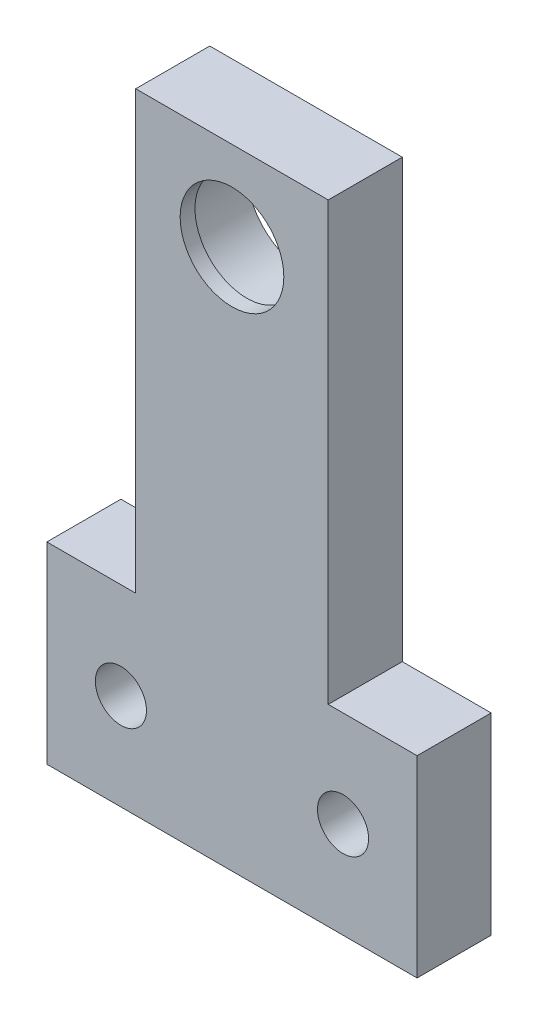
ISO-10303-21;
HEADER;
FILE_DESCRIPTION(('STEP AP214'),'2;1');
FILE_NAME('part.step','',(''),(''),'','','');
FILE_SCHEMA(('AUTOMOTIVE_DESIGN { 1 0 10303 214 1 1 1 1 }'));
ENDSEC;
DATA;
#1=APPLICATION_CONTEXT('core data for automotive mechanical design processes');
#2=APPLICATION_PROTOCOL_DEFINITION('international standard','automotive_design',2000,#1);
#3=PRODUCT_CONTEXT('',#1,'mechanical');
#4=PRODUCT('Part','Part','',(#3));
#5=PRODUCT_RELATED_PRODUCT_CATEGORY('part','',(#4));
#6=PRODUCT_DEFINITION_FORMATION('','',#4);
#7=PRODUCT_DEFINITION_CONTEXT('part definition',#1,'design');
#8=PRODUCT_DEFINITION('design','',#6,#7);
#9=PRODUCT_DEFINITION_SHAPE('','',#8);
#10=(LENGTH_UNIT() NAMED_UNIT(*) SI_UNIT(.MILLI.,.METRE.));
#11=(NAMED_UNIT(*) PLANE_ANGLE_UNIT() SI_UNIT($,.RADIAN.));
#12=(NAMED_UNIT(*) SI_UNIT($,.STERADIAN.) SOLID_ANGLE_UNIT());
#13=UNCERTAINTY_MEASURE_WITH_UNIT(LENGTH_MEASURE(1.E-05),#10,'distance_accuracy_value','');
#14=(GEOMETRIC_REPRESENTATION_CONTEXT(3) GLOBAL_UNCERTAINTY_ASSIGNED_CONTEXT((#13)) GLOBAL_UNIT_ASSIGNED_CONTEXT((#10,
#11,#12)) REPRESENTATION_CONTEXT('',''));
#15=CARTESIAN_POINT('',(0.,0.,0.));
#16=DIRECTION('',(0.,0.,1.));
#17=DIRECTION('',(1.,0.,0.));
#18=AXIS2_PLACEMENT_3D('',#15,#16,#17);
#19=CARTESIAN_POINT('',(0.,73.,10.));
#20=DIRECTION('',(0.,0.,-1.));
#21=DIRECTION('',(-1.,0.,0.));
#22=AXIS2_PLACEMENT_3D('',#19,#20,#21);
#23=CYLINDRICAL_SURFACE('',#22,7.);
#24=CARTESIAN_POINT('',(0.,73.,10.));
#25=DIRECTION('',(0.,0.,1.));
#26=DIRECTION('',(1.,0.,0.));
#27=AXIS2_PLACEMENT_3D('',#24,#25,#26);
#28=CIRCLE('',#27,7.);
#29=CARTESIAN_POINT('',(7.,73.,10.));
#30=VERTEX_POINT('',#29);
#31=EDGE_CURVE('E140',#30,#30,#28,.T.);
#32=ORIENTED_EDGE('',*,*,#31,.T.);
#33=EDGE_LOOP('',(#32));
#34=FACE_BOUND('',#33,.T.);
#35=CARTESIAN_POINT('',(0.,73.,8.));
#36=DIRECTION('',(0.,0.,-1.));
#37=DIRECTION('',(-1.,0.,0.));
#38=AXIS2_PLACEMENT_3D('',#35,#36,#37);
#39=CIRCLE('',#38,7.);
#40=CARTESIAN_POINT('',(-7.,73.,8.));
#41=VERTEX_POINT('',#40);
#42=EDGE_CURVE('E41',#41,#41,#39,.T.);
#43=ORIENTED_EDGE('',*,*,#42,.T.);
#44=EDGE_LOOP('',(#43));
#45=FACE_BOUND('',#44,.T.);
#46=ADVANCED_FACE('F37',(#34,#45),#23,.F.);
#47=CARTESIAN_POINT('',(0.,0.,10.));
#48=DIRECTION('',(0.,0.,1.));
#49=DIRECTION('',(1.,0.,0.));
#50=AXIS2_PLACEMENT_3D('',#47,#48,#49);
#51=PLANE('',#50);
#52=CARTESIAN_POINT('',(15.,13.,10.));
#53=DIRECTION('',(0.,0.,1.));
#54=DIRECTION('',(-1.,0.,0.));
#55=AXIS2_PLACEMENT_3D('',#52,#53,#54);
#56=CIRCLE('',#55,3.45000000000001);
#57=CARTESIAN_POINT('',(11.55,13.,10.));
#58=VERTEX_POINT('',#57);
#59=EDGE_CURVE('E188',#58,#58,#56,.T.);
#60=ORIENTED_EDGE('',*,*,#59,.F.);
#61=EDGE_LOOP('',(#60));
#62=FACE_BOUND('',#61,.T.);
#63=DIRECTION('',(0.,-1.,0.));
#64=VECTOR('',#63,1.);
#65=CARTESIAN_POINT('',(-25.,26.,10.));
#66=LINE('',#65,#64);
#67=CARTESIAN_POINT('',(-25.,26.,10.));
#68=VERTEX_POINT('',#67);
#69=CARTESIAN_POINT('',(-25.,0.,10.));
#70=VERTEX_POINT('',#69);
#71=EDGE_CURVE('E151',#68,#70,#66,.T.);
#72=ORIENTED_EDGE('',*,*,#71,.T.);
#73=DIRECTION('',(1.,0.,0.));
#74=VECTOR('',#73,1.);
#75=CARTESIAN_POINT('',(-25.,0.,10.));
#76=LINE('',#75,#74);
#77=CARTESIAN_POINT('',(25.,0.,10.));
#78=VERTEX_POINT('',#77);
#79=EDGE_CURVE('E98',#70,#78,#76,.T.);
#80=ORIENTED_EDGE('',*,*,#79,.T.);
#81=DIRECTION('',(0.,1.,0.));
#82=VECTOR('',#81,1.);
#83=CARTESIAN_POINT('',(25.,0.,10.));
#84=LINE('',#83,#82);
#85=CARTESIAN_POINT('',(25.,26.,10.));
#86=VERTEX_POINT('',#85);
#87=EDGE_CURVE('E167',#78,#86,#84,.T.);
#88=ORIENTED_EDGE('',*,*,#87,.T.);
#89=DIRECTION('',(-1.,0.,0.));
#90=VECTOR('',#89,1.);
#91=CARTESIAN_POINT('',(25.,26.,10.));
#92=LINE('',#91,#90);
#93=CARTESIAN_POINT('',(13.,26.,10.));
#94=VERTEX_POINT('',#93);
#95=EDGE_CURVE('E180',#86,#94,#92,.T.);
#96=ORIENTED_EDGE('',*,*,#95,.T.);
#97=DIRECTION('',(0.,1.,0.));
#98=VECTOR('',#97,1.);
#99=CARTESIAN_POINT('',(13.,26.,10.));
#100=LINE('',#99,#98);
#101=CARTESIAN_POINT('',(13.,85.,10.));
#102=VERTEX_POINT('',#101);
#103=EDGE_CURVE('E118',#94,#102,#100,.T.);
#104=ORIENTED_EDGE('',*,*,#103,.T.);
#105=DIRECTION('',(-1.,0.,0.));
#106=VECTOR('',#105,1.);
#107=CARTESIAN_POINT('',(13.,85.,10.));
#108=LINE('',#107,#106);
#109=CARTESIAN_POINT('',(-13.,85.,10.));
#110=VERTEX_POINT('',#109);
#111=EDGE_CURVE('E111',#102,#110,#108,.T.);
#112=ORIENTED_EDGE('',*,*,#111,.T.);
#113=DIRECTION('',(0.,-1.,0.));
#114=VECTOR('',#113,1.);
#115=CARTESIAN_POINT('',(-13.,85.,10.));
#116=LINE('',#115,#114);
#117=CARTESIAN_POINT('',(-13.,26.,10.));
#118=VERTEX_POINT('',#117);
#119=EDGE_CURVE('E116',#110,#118,#116,.T.);
#120=ORIENTED_EDGE('',*,*,#119,.T.);
#121=DIRECTION('',(-1.,0.,0.));
#122=VECTOR('',#121,1.);
#123=CARTESIAN_POINT('',(-13.,26.,10.));
#124=LINE('',#123,#122);
#125=EDGE_CURVE('E55',#118,#68,#124,.T.);
#126=ORIENTED_EDGE('',*,*,#125,.T.);
#127=EDGE_LOOP('',(#72,#80,#88,#96,#104,#112,#120,#126));
#128=FACE_BOUND('',#127,.T.);
#129=ORIENTED_EDGE('',*,*,#31,.F.);
#130=EDGE_LOOP('',(#129));
#131=FACE_BOUND('',#130,.T.);
#132=CARTESIAN_POINT('',(-15.,13.,10.));
#133=DIRECTION('',(0.,0.,1.));
#134=DIRECTION('',(1.,0.,0.));
#135=AXIS2_PLACEMENT_3D('',#132,#133,#134);
#136=CIRCLE('',#135,3.45);
#137=CARTESIAN_POINT('',(-11.55,13.,10.));
#138=VERTEX_POINT('',#137);
#139=EDGE_CURVE('E192',#138,#138,#136,.T.);
#140=ORIENTED_EDGE('',*,*,#139,.F.);
#141=EDGE_LOOP('',(#140));
#142=FACE_BOUND('',#141,.T.);
#143=ADVANCED_FACE('F113',(#62,#128,#131,#142),#51,.T.);
#144=CARTESIAN_POINT('',(0.,0.,0.));
#145=DIRECTION('',(0.,0.,1.));
#146=DIRECTION('',(1.,0.,0.));
#147=AXIS2_PLACEMENT_3D('',#144,#145,#146);
#148=PLANE('',#147);
#149=CARTESIAN_POINT('',(0.,73.,0.));
#150=DIRECTION('',(0.,0.,-1.));
#151=DIRECTION('',(-1.,0.,0.));
#152=AXIS2_PLACEMENT_3D('',#149,#150,#151);
#153=CIRCLE('',#152,8.05);
#154=CARTESIAN_POINT('',(-8.05,73.,0.));
#155=VERTEX_POINT('',#154);
#156=EDGE_CURVE('E200',#155,#155,#153,.T.);
#157=ORIENTED_EDGE('',*,*,#156,.F.);
#158=EDGE_LOOP('',(#157));
#159=FACE_BOUND('',#158,.T.);
#160=DIRECTION('',(0.,-1.,0.));
#161=VECTOR('',#160,1.);
#162=CARTESIAN_POINT('',(-25.,26.,0.));
#163=LINE('',#162,#161);
#164=CARTESIAN_POINT('',(-25.,26.,0.));
#165=VERTEX_POINT('',#164);
#166=CARTESIAN_POINT('',(-25.,0.,0.));
#167=VERTEX_POINT('',#166);
#168=EDGE_CURVE('E136',#165,#167,#163,.T.);
#169=ORIENTED_EDGE('',*,*,#168,.F.);
#170=DIRECTION('',(-1.,0.,0.));
#171=VECTOR('',#170,1.);
#172=CARTESIAN_POINT('',(-13.,26.,0.));
#173=LINE('',#172,#171);
#174=CARTESIAN_POINT('',(-13.,26.,0.));
#175=VERTEX_POINT('',#174);
#176=EDGE_CURVE('E90',#175,#165,#173,.T.);
#177=ORIENTED_EDGE('',*,*,#176,.F.);
#178=DIRECTION('',(0.,-1.,0.));
#179=VECTOR('',#178,1.);
#180=CARTESIAN_POINT('',(-13.,85.,0.));
#181=LINE('',#180,#179);
#182=CARTESIAN_POINT('',(-13.,85.,0.));
#183=VERTEX_POINT('',#182);
#184=EDGE_CURVE('E84',#183,#175,#181,.T.);
#185=ORIENTED_EDGE('',*,*,#184,.F.);
#186=DIRECTION('',(-1.,0.,0.));
#187=VECTOR('',#186,1.);
#188=CARTESIAN_POINT('',(13.,85.,0.));
#189=LINE('',#188,#187);
#190=CARTESIAN_POINT('',(13.,85.,0.));
#191=VERTEX_POINT('',#190);
#192=EDGE_CURVE('E126',#191,#183,#189,.T.);
#193=ORIENTED_EDGE('',*,*,#192,.F.);
#194=DIRECTION('',(0.,1.,0.));
#195=VECTOR('',#194,1.);
#196=CARTESIAN_POINT('',(13.,26.,0.));
#197=LINE('',#196,#195);
#198=CARTESIAN_POINT('',(13.,26.,0.));
#199=VERTEX_POINT('',#198);
#200=EDGE_CURVE('E146',#199,#191,#197,.T.);
#201=ORIENTED_EDGE('',*,*,#200,.F.);
#202=DIRECTION('',(-1.,0.,0.));
#203=VECTOR('',#202,1.);
#204=CARTESIAN_POINT('',(25.,26.,0.));
#205=LINE('',#204,#203);
#206=CARTESIAN_POINT('',(25.,26.,0.));
#207=VERTEX_POINT('',#206);
#208=EDGE_CURVE('E144',#207,#199,#205,.T.);
#209=ORIENTED_EDGE('',*,*,#208,.F.);
#210=DIRECTION('',(0.,1.,0.));
#211=VECTOR('',#210,1.);
#212=CARTESIAN_POINT('',(25.,0.,0.));
#213=LINE('',#212,#211);
#214=CARTESIAN_POINT('',(25.,0.,0.));
#215=VERTEX_POINT('',#214);
#216=EDGE_CURVE('E142',#215,#207,#213,.T.);
#217=ORIENTED_EDGE('',*,*,#216,.F.);
#218=DIRECTION('',(1.,0.,0.));
#219=VECTOR('',#218,1.);
#220=CARTESIAN_POINT('',(-25.,0.,0.));
#221=LINE('',#220,#219);
#222=EDGE_CURVE('E139',#167,#215,#221,.T.);
#223=ORIENTED_EDGE('',*,*,#222,.F.);
#224=EDGE_LOOP('',(#169,#177,#185,#193,#201,#209,#217,#223));
#225=FACE_BOUND('',#224,.T.);
#226=CARTESIAN_POINT('',(15.,13.,0.));
#227=DIRECTION('',(0.,0.,1.));
#228=DIRECTION('',(-1.,0.,0.));
#229=AXIS2_PLACEMENT_3D('',#226,#227,#228);
#230=CIRCLE('',#229,3.45000000000001);
#231=CARTESIAN_POINT('',(11.55,13.,0.));
#232=VERTEX_POINT('',#231);
#233=EDGE_CURVE('E189',#232,#232,#230,.T.);
#234=ORIENTED_EDGE('',*,*,#233,.T.);
#235=EDGE_LOOP('',(#234));
#236=FACE_BOUND('',#235,.T.);
#237=CARTESIAN_POINT('',(-15.,13.,0.));
#238=DIRECTION('',(0.,0.,1.));
#239=DIRECTION('',(1.,0.,0.));
#240=AXIS2_PLACEMENT_3D('',#237,#238,#239);
#241=CIRCLE('',#240,3.45);
#242=CARTESIAN_POINT('',(-11.55,13.,0.));
#243=VERTEX_POINT('',#242);
#244=EDGE_CURVE('E195',#243,#243,#241,.T.);
#245=ORIENTED_EDGE('',*,*,#244,.T.);
#246=EDGE_LOOP('',(#245));
#247=FACE_BOUND('',#246,.T.);
#248=ADVANCED_FACE('F171',(#159,#225,#236,#247),#148,.F.);
#249=CARTESIAN_POINT('',(-25.,26.,10.));
#250=DIRECTION('',(1.,0.,0.));
#251=DIRECTION('',(0.,1.,0.));
#252=AXIS2_PLACEMENT_3D('',#249,#250,#251);
#253=PLANE('',#252);
#254=ORIENTED_EDGE('',*,*,#168,.T.);
#255=DIRECTION('',(0.,0.,-1.));
#256=VECTOR('',#255,1.);
#257=CARTESIAN_POINT('',(-25.,0.,10.));
#258=LINE('',#257,#256);
#259=EDGE_CURVE('E11',#70,#167,#258,.T.);
#260=ORIENTED_EDGE('',*,*,#259,.F.);
#261=ORIENTED_EDGE('',*,*,#71,.F.);
#262=DIRECTION('',(0.,0.,-1.));
#263=VECTOR('',#262,1.);
#264=CARTESIAN_POINT('',(-25.,26.,10.));
#265=LINE('',#264,#263);
#266=EDGE_CURVE('E132',#68,#165,#265,.T.);
#267=ORIENTED_EDGE('',*,*,#266,.T.);
#268=EDGE_LOOP('',(#254,#260,#261,#267));
#269=FACE_BOUND('',#268,.T.);
#270=ADVANCED_FACE('F39',(#269),#253,.F.);
#271=CARTESIAN_POINT('',(-25.,0.,10.));
#272=DIRECTION('',(0.,1.,0.));
#273=DIRECTION('',(0.,0.,1.));
#274=AXIS2_PLACEMENT_3D('',#271,#272,#273);
#275=PLANE('',#274);
#276=ORIENTED_EDGE('',*,*,#222,.T.);
#277=DIRECTION('',(0.,0.,-1.));
#278=VECTOR('',#277,1.);
#279=CARTESIAN_POINT('',(25.,0.,10.));
#280=LINE('',#279,#278);
#281=EDGE_CURVE('E47',#78,#215,#280,.T.);
#282=ORIENTED_EDGE('',*,*,#281,.F.);
#283=ORIENTED_EDGE('',*,*,#79,.F.);
#284=ORIENTED_EDGE('',*,*,#259,.T.);
#285=EDGE_LOOP('',(#276,#282,#283,#284));
#286=FACE_BOUND('',#285,.T.);
#287=ADVANCED_FACE('F248',(#286),#275,.F.);
#288=CARTESIAN_POINT('',(25.,0.,10.));
#289=DIRECTION('',(-1.,0.,0.));
#290=DIRECTION('',(0.,-1.,0.));
#291=AXIS2_PLACEMENT_3D('',#288,#289,#290);
#292=PLANE('',#291);
#293=ORIENTED_EDGE('',*,*,#216,.T.);
#294=DIRECTION('',(0.,0.,-1.));
#295=VECTOR('',#294,1.);
#296=CARTESIAN_POINT('',(25.,26.,10.));
#297=LINE('',#296,#295);
#298=EDGE_CURVE('E158',#86,#207,#297,.T.);
#299=ORIENTED_EDGE('',*,*,#298,.F.);
#300=ORIENTED_EDGE('',*,*,#87,.F.);
#301=ORIENTED_EDGE('',*,*,#281,.T.);
#302=EDGE_LOOP('',(#293,#299,#300,#301));
#303=FACE_BOUND('',#302,.T.);
#304=ADVANCED_FACE('F165',(#303),#292,.F.);
#305=CARTESIAN_POINT('',(25.,26.,10.));
#306=DIRECTION('',(0.,-1.,0.));
#307=DIRECTION('',(1.,0.,0.));
#308=AXIS2_PLACEMENT_3D('',#305,#306,#307);
#309=PLANE('',#308);
#310=ORIENTED_EDGE('',*,*,#208,.T.);
#311=DIRECTION('',(0.,0.,-1.));
#312=VECTOR('',#311,1.);
#313=CARTESIAN_POINT('',(13.,26.,10.));
#314=LINE('',#313,#312);
#315=EDGE_CURVE('E155',#94,#199,#314,.T.);
#316=ORIENTED_EDGE('',*,*,#315,.F.);
#317=ORIENTED_EDGE('',*,*,#95,.F.);
#318=ORIENTED_EDGE('',*,*,#298,.T.);
#319=EDGE_LOOP('',(#310,#316,#317,#318));
#320=FACE_BOUND('',#319,.T.);
#321=ADVANCED_FACE('F176',(#320),#309,.F.);
#322=CARTESIAN_POINT('',(13.,26.,10.));
#323=DIRECTION('',(-1.,0.,0.));
#324=DIRECTION('',(0.,-1.,0.));
#325=AXIS2_PLACEMENT_3D('',#322,#323,#324);
#326=PLANE('',#325);
#327=ORIENTED_EDGE('',*,*,#200,.T.);
#328=DIRECTION('',(0.,0.,-1.));
#329=VECTOR('',#328,1.);
#330=CARTESIAN_POINT('',(13.,85.,10.));
#331=LINE('',#330,#329);
#332=EDGE_CURVE('E127',#102,#191,#331,.T.);
#333=ORIENTED_EDGE('',*,*,#332,.F.);
#334=ORIENTED_EDGE('',*,*,#103,.F.);
#335=ORIENTED_EDGE('',*,*,#315,.T.);
#336=EDGE_LOOP('',(#327,#333,#334,#335));
#337=FACE_BOUND('',#336,.T.);
#338=ADVANCED_FACE('F179',(#337),#326,.F.);
#339=CARTESIAN_POINT('',(13.,85.,10.));
#340=DIRECTION('',(0.,-1.,0.));
#341=DIRECTION('',(0.,0.,-1.));
#342=AXIS2_PLACEMENT_3D('',#339,#340,#341);
#343=PLANE('',#342);
#344=ORIENTED_EDGE('',*,*,#192,.T.);
#345=DIRECTION('',(0.,0.,-1.));
#346=VECTOR('',#345,1.);
#347=CARTESIAN_POINT('',(-13.,85.,10.));
#348=LINE('',#347,#346);
#349=EDGE_CURVE('E123',#110,#183,#348,.T.);
#350=ORIENTED_EDGE('',*,*,#349,.F.);
#351=ORIENTED_EDGE('',*,*,#111,.F.);
#352=ORIENTED_EDGE('',*,*,#332,.T.);
#353=EDGE_LOOP('',(#344,#350,#351,#352));
#354=FACE_BOUND('',#353,.T.);
#355=ADVANCED_FACE('F124',(#354),#343,.F.);
#356=CARTESIAN_POINT('',(-13.,85.,10.));
#357=DIRECTION('',(1.,0.,0.));
#358=DIRECTION('',(0.,1.,0.));
#359=AXIS2_PLACEMENT_3D('',#356,#357,#358);
#360=PLANE('',#359);
#361=ORIENTED_EDGE('',*,*,#184,.T.);
#362=DIRECTION('',(0.,0.,-1.));
#363=VECTOR('',#362,1.);
#364=CARTESIAN_POINT('',(-13.,26.,10.));
#365=LINE('',#364,#363);
#366=EDGE_CURVE('E128',#118,#175,#365,.T.);
#367=ORIENTED_EDGE('',*,*,#366,.F.);
#368=ORIENTED_EDGE('',*,*,#119,.F.);
#369=ORIENTED_EDGE('',*,*,#349,.T.);
#370=EDGE_LOOP('',(#361,#367,#368,#369));
#371=FACE_BOUND('',#370,.T.);
#372=ADVANCED_FACE('F130',(#371),#360,.F.);
#373=CARTESIAN_POINT('',(-13.,26.,10.));
#374=DIRECTION('',(0.,-1.,0.));
#375=DIRECTION('',(1.,0.,0.));
#376=AXIS2_PLACEMENT_3D('',#373,#374,#375);
#377=PLANE('',#376);
#378=ORIENTED_EDGE('',*,*,#176,.T.);
#379=ORIENTED_EDGE('',*,*,#266,.F.);
#380=ORIENTED_EDGE('',*,*,#125,.F.);
#381=ORIENTED_EDGE('',*,*,#366,.T.);
#382=EDGE_LOOP('',(#378,#379,#380,#381));
#383=FACE_BOUND('',#382,.T.);
#384=ADVANCED_FACE('F236',(#383),#377,.F.);
#385=CARTESIAN_POINT('',(15.,13.,10.));
#386=DIRECTION('',(0.,0.,-1.));
#387=DIRECTION('',(-1.,0.,0.));
#388=AXIS2_PLACEMENT_3D('',#385,#386,#387);
#389=CYLINDRICAL_SURFACE('',#388,3.45000000000001);
#390=ORIENTED_EDGE('',*,*,#59,.T.);
#391=EDGE_LOOP('',(#390));
#392=FACE_BOUND('',#391,.T.);
#393=ORIENTED_EDGE('',*,*,#233,.F.);
#394=EDGE_LOOP('',(#393));
#395=FACE_BOUND('',#394,.T.);
#396=ADVANCED_FACE('F230',(#392,#395),#389,.F.);
#397=CARTESIAN_POINT('',(-15.,13.,10.));
#398=DIRECTION('',(0.,0.,-1.));
#399=DIRECTION('',(-1.,0.,0.));
#400=AXIS2_PLACEMENT_3D('',#397,#398,#399);
#401=CYLINDRICAL_SURFACE('',#400,3.45);
#402=ORIENTED_EDGE('',*,*,#139,.T.);
#403=EDGE_LOOP('',(#402));
#404=FACE_BOUND('',#403,.T.);
#405=ORIENTED_EDGE('',*,*,#244,.F.);
#406=EDGE_LOOP('',(#405));
#407=FACE_BOUND('',#406,.T.);
#408=ADVANCED_FACE('F218',(#404,#407),#401,.F.);
#409=CARTESIAN_POINT('',(0.,73.,8.));
#410=DIRECTION('',(0.,0.,-1.));
#411=DIRECTION('',(-1.,0.,0.));
#412=AXIS2_PLACEMENT_3D('',#409,#410,#411);
#413=CYLINDRICAL_SURFACE('',#412,8.05);
#414=CARTESIAN_POINT('',(0.,73.,8.));
#415=DIRECTION('',(0.,0.,-1.));
#416=DIRECTION('',(-1.,0.,0.));
#417=AXIS2_PLACEMENT_3D('',#414,#415,#416);
#418=CIRCLE('',#417,8.05);
#419=CARTESIAN_POINT('',(-8.05,73.,8.));
#420=VERTEX_POINT('',#419);
#421=EDGE_CURVE('E203',#420,#420,#418,.T.);
#422=ORIENTED_EDGE('',*,*,#421,.F.);
#423=EDGE_LOOP('',(#422));
#424=FACE_BOUND('',#423,.T.);
#425=ORIENTED_EDGE('',*,*,#156,.T.);
#426=EDGE_LOOP('',(#425));
#427=FACE_BOUND('',#426,.T.);
#428=ADVANCED_FACE('F213',(#424,#427),#413,.F.);
#429=CARTESIAN_POINT('',(0.,73.,8.));
#430=DIRECTION('',(0.,0.,-1.));
#431=DIRECTION('',(-1.,0.,0.));
#432=AXIS2_PLACEMENT_3D('',#429,#430,#431);
#433=PLANE('',#432);
#434=ORIENTED_EDGE('',*,*,#42,.F.);
#435=EDGE_LOOP('',(#434));
#436=FACE_BOUND('',#435,.T.);
#437=ORIENTED_EDGE('',*,*,#421,.T.);
#438=EDGE_LOOP('',(#437));
#439=FACE_BOUND('',#438,.T.);
#440=ADVANCED_FACE('F211',(#436,#439),#433,.T.);
#441=CLOSED_SHELL('',(#46,#143,#248,#270,#287,#304,#321,#338,#355,#372,#384,#396,#408,#428,#440));
#442=MANIFOLD_SOLID_BREP('B2',#441);
#443=ADVANCED_BREP_SHAPE_REPRESENTATION('',(#18,#442),#14);
#444=SHAPE_DEFINITION_REPRESENTATION(#9,#443);
ENDSEC;
END-ISO-10303-21;
